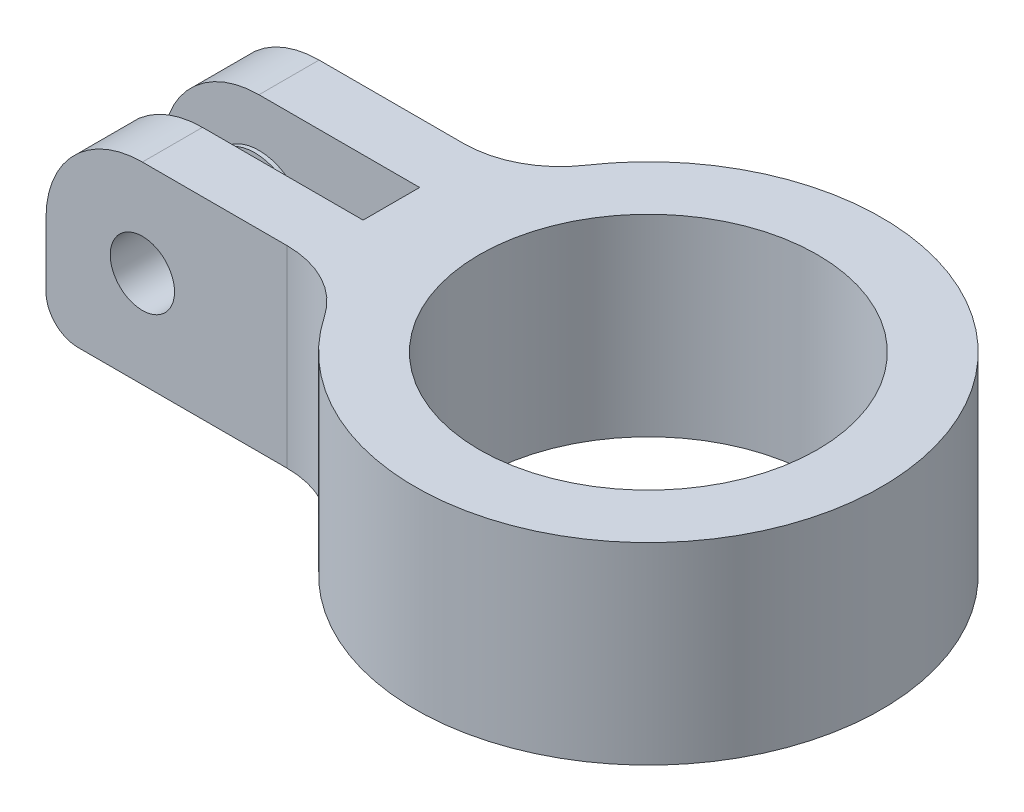
ISO-10303-21;
HEADER;
FILE_DESCRIPTION(('STEP AP214'),'2;1');
FILE_NAME('part.step','',(''),(''),'','','');
FILE_SCHEMA(('AUTOMOTIVE_DESIGN { 1 0 10303 214 1 1 1 1 }'));
ENDSEC;
DATA;
#1=APPLICATION_CONTEXT('core data for automotive mechanical design processes');
#2=APPLICATION_PROTOCOL_DEFINITION('international standard','automotive_design',2000,#1);
#3=PRODUCT_CONTEXT('',#1,'mechanical');
#4=PRODUCT('Part','Part','',(#3));
#5=PRODUCT_RELATED_PRODUCT_CATEGORY('part','',(#4));
#6=PRODUCT_DEFINITION_FORMATION('','',#4);
#7=PRODUCT_DEFINITION_CONTEXT('part definition',#1,'design');
#8=PRODUCT_DEFINITION('design','',#6,#7);
#9=PRODUCT_DEFINITION_SHAPE('','',#8);
#10=(LENGTH_UNIT() NAMED_UNIT(*) SI_UNIT(.MILLI.,.METRE.));
#11=(NAMED_UNIT(*) PLANE_ANGLE_UNIT() SI_UNIT($,.RADIAN.));
#12=(NAMED_UNIT(*) SI_UNIT($,.STERADIAN.) SOLID_ANGLE_UNIT());
#13=UNCERTAINTY_MEASURE_WITH_UNIT(LENGTH_MEASURE(1.E-05),#10,'distance_accuracy_value','');
#14=(GEOMETRIC_REPRESENTATION_CONTEXT(3) GLOBAL_UNCERTAINTY_ASSIGNED_CONTEXT((#13)) GLOBAL_UNIT_ASSIGNED_CONTEXT((#10,
#11,#12)) REPRESENTATION_CONTEXT('',''));
#15=CARTESIAN_POINT('',(0.,0.,0.));
#16=DIRECTION('',(0.,0.,1.));
#17=DIRECTION('',(1.,0.,0.));
#18=AXIS2_PLACEMENT_3D('',#15,#16,#17);
#19=CARTESIAN_POINT('',(0.,19.05,-2.794));
#20=DIRECTION('',(0.,0.,-1.));
#21=DIRECTION('',(-1.,0.,0.));
#22=AXIS2_PLACEMENT_3D('',#19,#20,#21);
#23=PLANE('',#22);
#24=DIRECTION('',(0.,-1.,0.));
#25=VECTOR('',#24,1.);
#26=CARTESIAN_POINT('',(-50.8,19.05,-2.794));
#27=LINE('',#26,#25);
#28=CARTESIAN_POINT('',(-50.8,9.525,-2.794));
#29=VERTEX_POINT('',#28);
#30=CARTESIAN_POINT('',(-50.8,3.17500000000001,-2.794));
#31=VERTEX_POINT('',#30);
#32=EDGE_CURVE('E170',#29,#31,#27,.T.);
#33=ORIENTED_EDGE('',*,*,#32,.T.);
#34=CARTESIAN_POINT('',(-47.625,3.175,-2.794));
#35=DIRECTION('',(0.,0.,-1.));
#36=DIRECTION('',(-1.,0.,0.));
#37=AXIS2_PLACEMENT_3D('',#34,#35,#36);
#38=CIRCLE('',#37,3.175);
#39=CARTESIAN_POINT('',(-47.625,0.,-2.794));
#40=VERTEX_POINT('',#39);
#41=EDGE_CURVE('E53',#31,#40,#38,.F.);
#42=ORIENTED_EDGE('',*,*,#41,.T.);
#43=DIRECTION('',(1.,0.,0.));
#44=VECTOR('',#43,1.);
#45=CARTESIAN_POINT('',(0.,0.,-2.794));
#46=LINE('',#45,#44);
#47=CARTESIAN_POINT('',(-25.4,0.,-2.794));
#48=VERTEX_POINT('',#47);
#49=EDGE_CURVE('E166',#40,#48,#46,.T.);
#50=ORIENTED_EDGE('',*,*,#49,.T.);
#51=DIRECTION('',(0.,-1.,0.));
#52=VECTOR('',#51,1.);
#53=CARTESIAN_POINT('',(-25.4,19.05,-2.794));
#54=LINE('',#53,#52);
#55=CARTESIAN_POINT('',(-25.4,19.05,-2.794));
#56=VERTEX_POINT('',#55);
#57=EDGE_CURVE('E162',#56,#48,#54,.T.);
#58=ORIENTED_EDGE('',*,*,#57,.F.);
#59=DIRECTION('',(1.,0.,0.));
#60=VECTOR('',#59,1.);
#61=CARTESIAN_POINT('',(0.,19.05,-2.794));
#62=LINE('',#61,#60);
#63=CARTESIAN_POINT('',(-41.275,19.05,-2.794));
#64=VERTEX_POINT('',#63);
#65=EDGE_CURVE('E146',#64,#56,#62,.T.);
#66=ORIENTED_EDGE('',*,*,#65,.F.);
#67=CARTESIAN_POINT('',(-41.275,9.525,-2.794));
#68=DIRECTION('',(0.,0.,-1.));
#69=DIRECTION('',(-1.,0.,0.));
#70=AXIS2_PLACEMENT_3D('',#67,#68,#69);
#71=CIRCLE('',#70,9.525);
#72=EDGE_CURVE('E265',#64,#29,#71,.F.);
#73=ORIENTED_EDGE('',*,*,#72,.T.);
#74=EDGE_LOOP('',(#33,#42,#50,#58,#66,#73));
#75=FACE_BOUND('',#74,.T.);
#76=CARTESIAN_POINT('',(-41.275,9.525,-2.794));
#77=DIRECTION('',(0.,0.,-1.));
#78=DIRECTION('',(-1.,0.,0.));
#79=AXIS2_PLACEMENT_3D('',#76,#77,#78);
#80=CIRCLE('',#79,4.7625);
#81=CARTESIAN_POINT('',(-46.0375,9.525,-2.794));
#82=VERTEX_POINT('',#81);
#83=EDGE_CURVE('E235',#82,#82,#80,.F.);
#84=ORIENTED_EDGE('',*,*,#83,.F.);
#85=EDGE_LOOP('',(#84));
#86=FACE_BOUND('',#85,.T.);
#87=ADVANCED_FACE('F44',(#75,#86),#23,.F.);
#88=CARTESIAN_POINT('',(0.,19.05,-8.73125));
#89=DIRECTION('',(0.,0.,1.));
#90=DIRECTION('',(1.,0.,0.));
#91=AXIS2_PLACEMENT_3D('',#88,#89,#90);
#92=PLANE('',#91);
#93=CARTESIAN_POINT('',(-41.275,9.525,-8.73125));
#94=DIRECTION('',(0.,0.,1.));
#95=DIRECTION('',(1.,0.,0.));
#96=AXIS2_PLACEMENT_3D('',#93,#94,#95);
#97=CIRCLE('',#96,3.17500000000001);
#98=CARTESIAN_POINT('',(-38.1,9.525,-8.73125));
#99=VERTEX_POINT('',#98);
#100=EDGE_CURVE('E199',#99,#99,#97,.T.);
#101=ORIENTED_EDGE('',*,*,#100,.T.);
#102=EDGE_LOOP('',(#101));
#103=FACE_BOUND('',#102,.T.);
#104=DIRECTION('',(-1.,0.,0.));
#105=VECTOR('',#104,1.);
#106=CARTESIAN_POINT('',(0.,0.,-8.73125));
#107=LINE('',#106,#105);
#108=CARTESIAN_POINT('',(-26.9791129614652,0.,-8.73125));
#109=VERTEX_POINT('',#108);
#110=CARTESIAN_POINT('',(-47.625,0.,-8.73125));
#111=VERTEX_POINT('',#110);
#112=EDGE_CURVE('E196',#109,#111,#107,.T.);
#113=ORIENTED_EDGE('',*,*,#112,.T.);
#114=CARTESIAN_POINT('',(-47.625,3.175,-8.73125));
#115=DIRECTION('',(0.,0.,1.));
#116=DIRECTION('',(1.,0.,0.));
#117=AXIS2_PLACEMENT_3D('',#114,#115,#116);
#118=CIRCLE('',#117,3.175);
#119=CARTESIAN_POINT('',(-50.8,3.17500000000001,-8.73125));
#120=VERTEX_POINT('',#119);
#121=EDGE_CURVE('E11',#111,#120,#118,.F.);
#122=ORIENTED_EDGE('',*,*,#121,.T.);
#123=DIRECTION('',(0.,-1.,0.));
#124=VECTOR('',#123,1.);
#125=CARTESIAN_POINT('',(-50.8,19.05,-8.73125));
#126=LINE('',#125,#124);
#127=CARTESIAN_POINT('',(-50.8,9.525,-8.73125));
#128=VERTEX_POINT('',#127);
#129=EDGE_CURVE('E232',#128,#120,#126,.T.);
#130=ORIENTED_EDGE('',*,*,#129,.F.);
#131=CARTESIAN_POINT('',(-41.275,9.525,-8.73125));
#132=DIRECTION('',(0.,0.,1.));
#133=DIRECTION('',(1.,0.,0.));
#134=AXIS2_PLACEMENT_3D('',#131,#132,#133);
#135=CIRCLE('',#134,9.525);
#136=CARTESIAN_POINT('',(-41.275,19.05,-8.73125));
#137=VERTEX_POINT('',#136);
#138=EDGE_CURVE('E252',#128,#137,#135,.F.);
#139=ORIENTED_EDGE('',*,*,#138,.T.);
#140=DIRECTION('',(-1.,0.,0.));
#141=VECTOR('',#140,1.);
#142=CARTESIAN_POINT('',(0.,19.05,-8.73125));
#143=LINE('',#142,#141);
#144=CARTESIAN_POINT('',(-26.9791129614652,19.05,-8.73125));
#145=VERTEX_POINT('',#144);
#146=EDGE_CURVE('E159',#145,#137,#143,.T.);
#147=ORIENTED_EDGE('',*,*,#146,.F.);
#148=DIRECTION('',(0.,1.,0.));
#149=VECTOR('',#148,1.);
#150=CARTESIAN_POINT('',(-26.9791129614652,0.,-8.73125));
#151=LINE('',#150,#149);
#152=EDGE_CURVE('E255',#145,#109,#151,.F.);
#153=ORIENTED_EDGE('',*,*,#152,.T.);
#154=EDGE_LOOP('',(#113,#122,#130,#139,#147,#153));
#155=FACE_BOUND('',#154,.T.);
#156=ADVANCED_FACE('F318',(#103,#155),#92,.F.);
#157=CARTESIAN_POINT('',(-50.8,19.05,0.));
#158=DIRECTION('',(1.,0.,0.));
#159=DIRECTION('',(0.,0.,-1.));
#160=AXIS2_PLACEMENT_3D('',#157,#158,#159);
#161=PLANE('',#160);
#162=ORIENTED_EDGE('',*,*,#129,.T.);
#163=DIRECTION('',(0.,0.,1.));
#164=VECTOR('',#163,1.);
#165=CARTESIAN_POINT('',(-50.8,3.175,0.));
#166=LINE('',#165,#164);
#167=EDGE_CURVE('E305',#120,#31,#166,.T.);
#168=ORIENTED_EDGE('',*,*,#167,.T.);
#169=ORIENTED_EDGE('',*,*,#32,.F.);
#170=DIRECTION('',(0.,0.,1.));
#171=VECTOR('',#170,1.);
#172=CARTESIAN_POINT('',(-50.8,9.525,-8.73125));
#173=LINE('',#172,#171);
#174=EDGE_CURVE('E268',#29,#128,#173,.F.);
#175=ORIENTED_EDGE('',*,*,#174,.T.);
#176=EDGE_LOOP('',(#162,#168,#169,#175));
#177=FACE_BOUND('',#176,.T.);
#178=ADVANCED_FACE('F315',(#177),#161,.F.);
#179=CARTESIAN_POINT('',(-25.4,19.05,0.));
#180=DIRECTION('',(1.,0.,0.));
#181=DIRECTION('',(0.,0.,-1.));
#182=AXIS2_PLACEMENT_3D('',#179,#180,#181);
#183=PLANE('',#182);
#184=DIRECTION('',(0.,0.,1.));
#185=VECTOR('',#184,1.);
#186=CARTESIAN_POINT('',(-25.4,0.,0.));
#187=LINE('',#186,#185);
#188=CARTESIAN_POINT('',(-25.4,0.,2.794));
#189=VERTEX_POINT('',#188);
#190=EDGE_CURVE('E202',#48,#189,#187,.T.);
#191=ORIENTED_EDGE('',*,*,#190,.T.);
#192=DIRECTION('',(0.,-1.,0.));
#193=VECTOR('',#192,1.);
#194=CARTESIAN_POINT('',(-25.4,19.05,2.794));
#195=LINE('',#194,#193);
#196=CARTESIAN_POINT('',(-25.4,19.05,2.794));
#197=VERTEX_POINT('',#196);
#198=EDGE_CURVE('E171',#197,#189,#195,.T.);
#199=ORIENTED_EDGE('',*,*,#198,.F.);
#200=DIRECTION('',(0.,0.,1.));
#201=VECTOR('',#200,1.);
#202=CARTESIAN_POINT('',(-25.4,19.05,0.));
#203=LINE('',#202,#201);
#204=EDGE_CURVE('E153',#56,#197,#203,.T.);
#205=ORIENTED_EDGE('',*,*,#204,.F.);
#206=ORIENTED_EDGE('',*,*,#57,.T.);
#207=EDGE_LOOP('',(#191,#199,#205,#206));
#208=FACE_BOUND('',#207,.T.);
#209=ADVANCED_FACE('F173',(#208),#183,.F.);
#210=CARTESIAN_POINT('',(0.,19.05,2.794));
#211=DIRECTION('',(0.,0.,1.));
#212=DIRECTION('',(1.,0.,0.));
#213=AXIS2_PLACEMENT_3D('',#210,#211,#212);
#214=PLANE('',#213);
#215=CARTESIAN_POINT('',(-41.275,9.525,2.794));
#216=DIRECTION('',(0.,0.,1.));
#217=DIRECTION('',(1.,0.,0.));
#218=AXIS2_PLACEMENT_3D('',#215,#216,#217);
#219=CIRCLE('',#218,4.7625);
#220=CARTESIAN_POINT('',(-36.5125,9.525,2.794));
#221=VERTEX_POINT('',#220);
#222=EDGE_CURVE('E378',#221,#221,#219,.T.);
#223=ORIENTED_EDGE('',*,*,#222,.T.);
#224=EDGE_LOOP('',(#223));
#225=FACE_BOUND('',#224,.T.);
#226=DIRECTION('',(-1.,0.,0.));
#227=VECTOR('',#226,1.);
#228=CARTESIAN_POINT('',(0.,0.,2.794));
#229=LINE('',#228,#227);
#230=CARTESIAN_POINT('',(-47.625,0.,2.794));
#231=VERTEX_POINT('',#230);
#232=EDGE_CURVE('E205',#189,#231,#229,.T.);
#233=ORIENTED_EDGE('',*,*,#232,.T.);
#234=CARTESIAN_POINT('',(-47.625,3.175,2.794));
#235=DIRECTION('',(0.,0.,1.));
#236=DIRECTION('',(1.,0.,0.));
#237=AXIS2_PLACEMENT_3D('',#234,#235,#236);
#238=CIRCLE('',#237,3.175);
#239=CARTESIAN_POINT('',(-50.8,3.17500000000001,2.794));
#240=VERTEX_POINT('',#239);
#241=EDGE_CURVE('E302',#231,#240,#238,.F.);
#242=ORIENTED_EDGE('',*,*,#241,.T.);
#243=DIRECTION('',(0.,-1.,0.));
#244=VECTOR('',#243,1.);
#245=CARTESIAN_POINT('',(-50.8,19.05,2.794));
#246=LINE('',#245,#244);
#247=CARTESIAN_POINT('',(-50.8,9.525,2.794));
#248=VERTEX_POINT('',#247);
#249=EDGE_CURVE('E224',#248,#240,#246,.T.);
#250=ORIENTED_EDGE('',*,*,#249,.F.);
#251=CARTESIAN_POINT('',(-41.275,9.525,2.794));
#252=DIRECTION('',(0.,0.,1.));
#253=DIRECTION('',(1.,0.,0.));
#254=AXIS2_PLACEMENT_3D('',#251,#252,#253);
#255=CIRCLE('',#254,9.525);
#256=CARTESIAN_POINT('',(-41.275,19.05,2.794));
#257=VERTEX_POINT('',#256);
#258=EDGE_CURVE('E274',#248,#257,#255,.F.);
#259=ORIENTED_EDGE('',*,*,#258,.T.);
#260=DIRECTION('',(-1.,0.,0.));
#261=VECTOR('',#260,1.);
#262=CARTESIAN_POINT('',(0.,19.05,2.794));
#263=LINE('',#262,#261);
#264=EDGE_CURVE('E177',#197,#257,#263,.T.);
#265=ORIENTED_EDGE('',*,*,#264,.F.);
#266=ORIENTED_EDGE('',*,*,#198,.T.);
#267=EDGE_LOOP('',(#233,#242,#250,#259,#265,#266));
#268=FACE_BOUND('',#267,.T.);
#269=ADVANCED_FACE('F433',(#225,#268),#214,.F.);
#270=CARTESIAN_POINT('',(-50.8,19.05,0.));
#271=DIRECTION('',(1.,0.,0.));
#272=DIRECTION('',(0.,0.,-1.));
#273=AXIS2_PLACEMENT_3D('',#270,#271,#272);
#274=PLANE('',#273);
#275=ORIENTED_EDGE('',*,*,#249,.T.);
#276=DIRECTION('',(0.,0.,1.));
#277=VECTOR('',#276,1.);
#278=CARTESIAN_POINT('',(-50.8,3.175,0.));
#279=LINE('',#278,#277);
#280=CARTESIAN_POINT('',(-50.8,3.17500000000001,8.73125));
#281=VERTEX_POINT('',#280);
#282=EDGE_CURVE('E289',#240,#281,#279,.T.);
#283=ORIENTED_EDGE('',*,*,#282,.T.);
#284=DIRECTION('',(0.,-1.,0.));
#285=VECTOR('',#284,1.);
#286=CARTESIAN_POINT('',(-50.8,19.05,8.73125));
#287=LINE('',#286,#285);
#288=CARTESIAN_POINT('',(-50.8,9.525,8.73125));
#289=VERTEX_POINT('',#288);
#290=EDGE_CURVE('E195',#289,#281,#287,.T.);
#291=ORIENTED_EDGE('',*,*,#290,.F.);
#292=DIRECTION('',(0.,0.,1.));
#293=VECTOR('',#292,1.);
#294=CARTESIAN_POINT('',(-50.8,9.525,2.794));
#295=LINE('',#294,#293);
#296=EDGE_CURVE('E271',#289,#248,#295,.F.);
#297=ORIENTED_EDGE('',*,*,#296,.T.);
#298=EDGE_LOOP('',(#275,#283,#291,#297));
#299=FACE_BOUND('',#298,.T.);
#300=ADVANCED_FACE('F430',(#299),#274,.F.);
#301=CARTESIAN_POINT('',(0.,19.05,8.73125));
#302=DIRECTION('',(0.,0.,1.));
#303=DIRECTION('',(1.,0.,0.));
#304=AXIS2_PLACEMENT_3D('',#301,#302,#303);
#305=PLANE('',#304);
#306=ORIENTED_EDGE('',*,*,#290,.T.);
#307=CARTESIAN_POINT('',(-47.625,3.175,8.73125));
#308=DIRECTION('',(0.,0.,1.));
#309=DIRECTION('',(1.,0.,0.));
#310=AXIS2_PLACEMENT_3D('',#307,#308,#309);
#311=CIRCLE('',#310,3.175);
#312=CARTESIAN_POINT('',(-47.625,0.,8.73125));
#313=VERTEX_POINT('',#312);
#314=EDGE_CURVE('E293',#281,#313,#311,.T.);
#315=ORIENTED_EDGE('',*,*,#314,.T.);
#316=DIRECTION('',(-1.,0.,0.));
#317=VECTOR('',#316,1.);
#318=CARTESIAN_POINT('',(0.,0.,8.73125));
#319=LINE('',#318,#317);
#320=CARTESIAN_POINT('',(-26.9791129614652,0.,8.73125));
#321=VERTEX_POINT('',#320);
#322=EDGE_CURVE('E209',#321,#313,#319,.T.);
#323=ORIENTED_EDGE('',*,*,#322,.F.);
#324=DIRECTION('',(0.,-1.,0.));
#325=VECTOR('',#324,1.);
#326=CARTESIAN_POINT('',(-26.9791129614652,19.05,8.73125));
#327=LINE('',#326,#325);
#328=CARTESIAN_POINT('',(-26.9791129614652,19.05,8.73125));
#329=VERTEX_POINT('',#328);
#330=EDGE_CURVE('E249',#321,#329,#327,.F.);
#331=ORIENTED_EDGE('',*,*,#330,.T.);
#332=DIRECTION('',(-1.,0.,0.));
#333=VECTOR('',#332,1.);
#334=CARTESIAN_POINT('',(0.,19.05,8.73125));
#335=LINE('',#334,#333);
#336=CARTESIAN_POINT('',(-41.275,19.05,8.73125));
#337=VERTEX_POINT('',#336);
#338=EDGE_CURVE('E180',#329,#337,#335,.T.);
#339=ORIENTED_EDGE('',*,*,#338,.T.);
#340=CARTESIAN_POINT('',(-41.275,9.525,8.73125));
#341=DIRECTION('',(0.,0.,1.));
#342=DIRECTION('',(1.,0.,0.));
#343=AXIS2_PLACEMENT_3D('',#340,#341,#342);
#344=CIRCLE('',#343,9.525);
#345=EDGE_CURVE('E246',#337,#289,#344,.T.);
#346=ORIENTED_EDGE('',*,*,#345,.T.);
#347=EDGE_LOOP('',(#306,#315,#323,#331,#339,#346));
#348=FACE_BOUND('',#347,.T.);
#349=CARTESIAN_POINT('',(-41.275,9.525,8.73125));
#350=DIRECTION('',(0.,0.,1.));
#351=DIRECTION('',(1.,0.,0.));
#352=AXIS2_PLACEMENT_3D('',#349,#350,#351);
#353=CIRCLE('',#352,3.17500000000001);
#354=CARTESIAN_POINT('',(-38.1,9.525,8.73125));
#355=VERTEX_POINT('',#354);
#356=EDGE_CURVE('E374',#355,#355,#353,.T.);
#357=ORIENTED_EDGE('',*,*,#356,.F.);
#358=EDGE_LOOP('',(#357));
#359=FACE_BOUND('',#358,.T.);
#360=ADVANCED_FACE('F427',(#348,#359),#305,.T.);
#361=CARTESIAN_POINT('',(0.,19.05,0.));
#362=DIRECTION('',(0.,-1.,0.));
#363=DIRECTION('',(0.,0.,-1.));
#364=AXIS2_PLACEMENT_3D('',#361,#362,#363);
#365=CYLINDRICAL_SURFACE('',#364,23.0505);
#366=CARTESIAN_POINT('',(0.,19.05,0.));
#367=DIRECTION('',(0.,1.,0.));
#368=DIRECTION('',(0.,0.,1.));
#369=AXIS2_PLACEMENT_3D('',#366,#367,#368);
#370=CIRCLE('',#369,23.0505);
#371=CARTESIAN_POINT('',(-19.090483440569,19.05,12.9181652046784));
#372=VERTEX_POINT('',#371);
#373=CARTESIAN_POINT('',(-19.090483440569,19.05,-12.9181652046784));
#374=VERTEX_POINT('',#373);
#375=EDGE_CURVE('E187',#372,#374,#370,.T.);
#376=ORIENTED_EDGE('',*,*,#375,.F.);
#377=DIRECTION('',(0.,-1.,0.));
#378=VECTOR('',#377,1.);
#379=CARTESIAN_POINT('',(-19.090483440569,19.05,12.9181652046784));
#380=LINE('',#379,#378);
#381=CARTESIAN_POINT('',(-19.090483440569,0.,12.9181652046784));
#382=VERTEX_POINT('',#381);
#383=EDGE_CURVE('E242',#372,#382,#380,.T.);
#384=ORIENTED_EDGE('',*,*,#383,.T.);
#385=CARTESIAN_POINT('',(0.,0.,0.));
#386=DIRECTION('',(0.,1.,0.));
#387=DIRECTION('',(0.,0.,1.));
#388=AXIS2_PLACEMENT_3D('',#385,#386,#387);
#389=CIRCLE('',#388,23.0505);
#390=CARTESIAN_POINT('',(-19.090483440569,0.,-12.9181652046784));
#391=VERTEX_POINT('',#390);
#392=EDGE_CURVE('E213',#382,#391,#389,.T.);
#393=ORIENTED_EDGE('',*,*,#392,.T.);
#394=DIRECTION('',(0.,-1.,0.));
#395=VECTOR('',#394,1.);
#396=CARTESIAN_POINT('',(-19.090483440569,19.05,-12.9181652046784));
#397=LINE('',#396,#395);
#398=EDGE_CURVE('E239',#391,#374,#397,.F.);
#399=ORIENTED_EDGE('',*,*,#398,.T.);
#400=EDGE_LOOP('',(#376,#384,#393,#399));
#401=FACE_BOUND('',#400,.T.);
#402=ADVANCED_FACE('F365',(#401),#365,.T.);
#403=CARTESIAN_POINT('',(0.,19.05,0.));
#404=DIRECTION('',(0.,-1.,0.));
#405=DIRECTION('',(0.,0.,-1.));
#406=AXIS2_PLACEMENT_3D('',#403,#404,#405);
#407=CYLINDRICAL_SURFACE('',#406,16.7005);
#408=CARTESIAN_POINT('',(0.,19.05,0.));
#409=DIRECTION('',(0.,1.,0.));
#410=DIRECTION('',(0.,0.,1.));
#411=AXIS2_PLACEMENT_3D('',#408,#409,#410);
#412=CIRCLE('',#411,16.7005);
#413=CARTESIAN_POINT('',(0.,19.05,16.7005));
#414=VERTEX_POINT('',#413);
#415=EDGE_CURVE('E191',#414,#414,#412,.T.);
#416=ORIENTED_EDGE('',*,*,#415,.T.);
#417=EDGE_LOOP('',(#416));
#418=FACE_BOUND('',#417,.T.);
#419=CARTESIAN_POINT('',(0.,0.,0.));
#420=DIRECTION('',(0.,1.,0.));
#421=DIRECTION('',(0.,0.,1.));
#422=AXIS2_PLACEMENT_3D('',#419,#420,#421);
#423=CIRCLE('',#422,16.7005);
#424=CARTESIAN_POINT('',(0.,0.,16.7005));
#425=VERTEX_POINT('',#424);
#426=EDGE_CURVE('E217',#425,#425,#423,.T.);
#427=ORIENTED_EDGE('',*,*,#426,.F.);
#428=EDGE_LOOP('',(#427));
#429=FACE_BOUND('',#428,.T.);
#430=ADVANCED_FACE('F419',(#418,#429),#407,.F.);
#431=CARTESIAN_POINT('',(0.,19.05,0.));
#432=DIRECTION('',(0.,1.,0.));
#433=DIRECTION('',(0.,0.,1.));
#434=AXIS2_PLACEMENT_3D('',#431,#432,#433);
#435=PLANE('',#434);
#436=ORIENTED_EDGE('',*,*,#146,.T.);
#437=DIRECTION('',(0.,0.,1.));
#438=VECTOR('',#437,1.);
#439=CARTESIAN_POINT('',(-41.275,19.05,-2.794));
#440=LINE('',#439,#438);
#441=EDGE_CURVE('E156',#137,#64,#440,.T.);
#442=ORIENTED_EDGE('',*,*,#441,.T.);
#443=ORIENTED_EDGE('',*,*,#65,.T.);
#444=ORIENTED_EDGE('',*,*,#204,.T.);
#445=ORIENTED_EDGE('',*,*,#264,.T.);
#446=DIRECTION('',(0.,0.,1.));
#447=VECTOR('',#446,1.);
#448=CARTESIAN_POINT('',(-41.275,19.05,8.73125));
#449=LINE('',#448,#447);
#450=EDGE_CURVE('E259',#257,#337,#449,.T.);
#451=ORIENTED_EDGE('',*,*,#450,.T.);
#452=ORIENTED_EDGE('',*,*,#338,.F.);
#453=CARTESIAN_POINT('',(-26.9791129614652,19.05,18.25625));
#454=DIRECTION('',(0.,1.,0.));
#455=DIRECTION('',(0.,0.,1.));
#456=AXIS2_PLACEMENT_3D('',#453,#454,#455);
#457=CIRCLE('',#456,9.525);
#458=EDGE_CURVE('E280',#329,#372,#457,.F.);
#459=ORIENTED_EDGE('',*,*,#458,.T.);
#460=ORIENTED_EDGE('',*,*,#375,.T.);
#461=CARTESIAN_POINT('',(-26.9791129614652,19.05,-18.25625));
#462=DIRECTION('',(0.,1.,0.));
#463=DIRECTION('',(0.,0.,1.));
#464=AXIS2_PLACEMENT_3D('',#461,#462,#463);
#465=CIRCLE('',#464,9.525);
#466=EDGE_CURVE('E286',#374,#145,#465,.F.);
#467=ORIENTED_EDGE('',*,*,#466,.T.);
#468=EDGE_LOOP('',(#436,#442,#443,#444,#445,#451,#452,#459,#460,#467));
#469=FACE_BOUND('',#468,.T.);
#470=ORIENTED_EDGE('',*,*,#415,.F.);
#471=EDGE_LOOP('',(#470));
#472=FACE_BOUND('',#471,.T.);
#473=ADVANCED_FACE('F149',(#469,#472),#435,.T.);
#474=CARTESIAN_POINT('',(0.,0.,0.));
#475=DIRECTION('',(0.,1.,0.));
#476=DIRECTION('',(0.,0.,1.));
#477=AXIS2_PLACEMENT_3D('',#474,#475,#476);
#478=PLANE('',#477);
#479=ORIENTED_EDGE('',*,*,#322,.T.);
#480=DIRECTION('',(0.,0.,1.));
#481=VECTOR('',#480,1.);
#482=CARTESIAN_POINT('',(-47.625,0.,0.));
#483=LINE('',#482,#481);
#484=EDGE_CURVE('E299',#313,#231,#483,.F.);
#485=ORIENTED_EDGE('',*,*,#484,.T.);
#486=ORIENTED_EDGE('',*,*,#232,.F.);
#487=ORIENTED_EDGE('',*,*,#190,.F.);
#488=ORIENTED_EDGE('',*,*,#49,.F.);
#489=DIRECTION('',(0.,0.,1.));
#490=VECTOR('',#489,1.);
#491=CARTESIAN_POINT('',(-47.625,0.,0.));
#492=LINE('',#491,#490);
#493=EDGE_CURVE('E296',#40,#111,#492,.F.);
#494=ORIENTED_EDGE('',*,*,#493,.T.);
#495=ORIENTED_EDGE('',*,*,#112,.F.);
#496=CARTESIAN_POINT('',(-26.9791129614652,0.,-18.25625));
#497=DIRECTION('',(0.,1.,0.));
#498=DIRECTION('',(0.,0.,1.));
#499=AXIS2_PLACEMENT_3D('',#496,#497,#498);
#500=CIRCLE('',#499,9.525);
#501=EDGE_CURVE('E283',#109,#391,#500,.T.);
#502=ORIENTED_EDGE('',*,*,#501,.T.);
#503=ORIENTED_EDGE('',*,*,#392,.F.);
#504=CARTESIAN_POINT('',(-26.9791129614652,0.,18.25625));
#505=DIRECTION('',(0.,1.,0.));
#506=DIRECTION('',(0.,0.,1.));
#507=AXIS2_PLACEMENT_3D('',#504,#505,#506);
#508=CIRCLE('',#507,9.525);
#509=EDGE_CURVE('E277',#382,#321,#508,.T.);
#510=ORIENTED_EDGE('',*,*,#509,.T.);
#511=EDGE_LOOP('',(#479,#485,#486,#487,#488,#494,#495,#502,#503,#510));
#512=FACE_BOUND('',#511,.T.);
#513=ORIENTED_EDGE('',*,*,#426,.T.);
#514=EDGE_LOOP('',(#513));
#515=FACE_BOUND('',#514,.T.);
#516=ADVANCED_FACE('F310',(#512,#515),#478,.F.);
#517=CARTESIAN_POINT('',(-41.275,9.525,-23.0505));
#518=DIRECTION('',(0.,0.,1.));
#519=DIRECTION('',(1.,0.,0.));
#520=AXIS2_PLACEMENT_3D('',#517,#518,#519);
#521=CYLINDRICAL_SURFACE('',#520,3.17500000000001);
#522=ORIENTED_EDGE('',*,*,#356,.T.);
#523=EDGE_LOOP('',(#522));
#524=FACE_BOUND('',#523,.T.);
#525=CARTESIAN_POINT('',(-41.275,9.525,2.38125));
#526=DIRECTION('',(0.,0.,1.));
#527=DIRECTION('',(1.,0.,0.));
#528=AXIS2_PLACEMENT_3D('',#525,#526,#527);
#529=CIRCLE('',#528,3.17500000000001);
#530=CARTESIAN_POINT('',(-38.1,9.525,2.38125));
#531=VERTEX_POINT('',#530);
#532=EDGE_CURVE('E386',#531,#531,#529,.T.);
#533=ORIENTED_EDGE('',*,*,#532,.F.);
#534=EDGE_LOOP('',(#533));
#535=FACE_BOUND('',#534,.T.);
#536=ADVANCED_FACE('F403',(#524,#535),#521,.F.);
#537=ORIENTED_EDGE('',*,*,#100,.F.);
#538=EDGE_LOOP('',(#537));
#539=FACE_BOUND('',#538,.T.);
#540=CARTESIAN_POINT('',(-41.275,9.525,-2.38125));
#541=DIRECTION('',(0.,0.,1.));
#542=DIRECTION('',(1.,0.,0.));
#543=AXIS2_PLACEMENT_3D('',#540,#541,#542);
#544=CIRCLE('',#543,3.17500000000001);
#545=CARTESIAN_POINT('',(-38.1,9.525,-2.38125));
#546=VERTEX_POINT('',#545);
#547=EDGE_CURVE('E394',#546,#546,#544,.T.);
#548=ORIENTED_EDGE('',*,*,#547,.T.);
#549=EDGE_LOOP('',(#548));
#550=FACE_BOUND('',#549,.T.);
#551=ADVANCED_FACE('F399',(#539,#550),#521,.F.);
#552=CARTESIAN_POINT('',(-41.275,9.525,2.38125));
#553=DIRECTION('',(0.,0.,1.));
#554=DIRECTION('',(1.,0.,0.));
#555=AXIS2_PLACEMENT_3D('',#552,#553,#554);
#556=CYLINDRICAL_SURFACE('',#555,4.7625);
#557=CARTESIAN_POINT('',(-41.275,9.525,2.38125));
#558=DIRECTION('',(0.,0.,1.));
#559=DIRECTION('',(1.,0.,0.));
#560=AXIS2_PLACEMENT_3D('',#557,#558,#559);
#561=CIRCLE('',#560,4.7625);
#562=CARTESIAN_POINT('',(-36.5125,9.525,2.38125));
#563=VERTEX_POINT('',#562);
#564=EDGE_CURVE('E382',#563,#563,#561,.T.);
#565=ORIENTED_EDGE('',*,*,#564,.T.);
#566=EDGE_LOOP('',(#565));
#567=FACE_BOUND('',#566,.T.);
#568=ORIENTED_EDGE('',*,*,#222,.F.);
#569=EDGE_LOOP('',(#568));
#570=FACE_BOUND('',#569,.T.);
#571=ADVANCED_FACE('F402',(#567,#570),#556,.T.);
#572=CARTESIAN_POINT('',(-41.275,9.525,2.38125));
#573=DIRECTION('',(0.,0.,1.));
#574=DIRECTION('',(1.,0.,0.));
#575=AXIS2_PLACEMENT_3D('',#572,#573,#574);
#576=PLANE('',#575);
#577=ORIENTED_EDGE('',*,*,#532,.T.);
#578=EDGE_LOOP('',(#577));
#579=FACE_BOUND('',#578,.T.);
#580=ORIENTED_EDGE('',*,*,#564,.F.);
#581=EDGE_LOOP('',(#580));
#582=FACE_BOUND('',#581,.T.);
#583=ADVANCED_FACE('F410',(#579,#582),#576,.F.);
#584=CARTESIAN_POINT('',(-41.275,9.525,-2.38125));
#585=DIRECTION('',(0.,0.,-1.));
#586=DIRECTION('',(-1.,0.,0.));
#587=AXIS2_PLACEMENT_3D('',#584,#585,#586);
#588=CYLINDRICAL_SURFACE('',#587,4.7625);
#589=CARTESIAN_POINT('',(-41.275,9.525,-2.38125));
#590=DIRECTION('',(0.,0.,1.));
#591=DIRECTION('',(1.,0.,0.));
#592=AXIS2_PLACEMENT_3D('',#589,#590,#591);
#593=CIRCLE('',#592,4.7625);
#594=CARTESIAN_POINT('',(-36.5125,9.525,-2.38125));
#595=VERTEX_POINT('',#594);
#596=EDGE_CURVE('E390',#595,#595,#593,.T.);
#597=ORIENTED_EDGE('',*,*,#596,.F.);
#598=EDGE_LOOP('',(#597));
#599=FACE_BOUND('',#598,.T.);
#600=ORIENTED_EDGE('',*,*,#83,.T.);
#601=EDGE_LOOP('',(#600));
#602=FACE_BOUND('',#601,.T.);
#603=ADVANCED_FACE('F355',(#599,#602),#588,.T.);
#604=CARTESIAN_POINT('',(-41.275,9.525,-2.38125));
#605=DIRECTION('',(0.,0.,-1.));
#606=DIRECTION('',(1.,0.,0.));
#607=AXIS2_PLACEMENT_3D('',#604,#605,#606);
#608=PLANE('',#607);
#609=ORIENTED_EDGE('',*,*,#596,.T.);
#610=EDGE_LOOP('',(#609));
#611=FACE_BOUND('',#610,.T.);
#612=ORIENTED_EDGE('',*,*,#547,.F.);
#613=EDGE_LOOP('',(#612));
#614=FACE_BOUND('',#613,.T.);
#615=ADVANCED_FACE('F350',(#611,#614),#608,.F.);
#616=CARTESIAN_POINT('',(-26.9791129614652,19.05,18.25625));
#617=DIRECTION('',(0.,-1.,0.));
#618=DIRECTION('',(0.,0.,-1.));
#619=AXIS2_PLACEMENT_3D('',#616,#617,#618);
#620=CYLINDRICAL_SURFACE('',#619,9.525);
#621=ORIENTED_EDGE('',*,*,#458,.F.);
#622=ORIENTED_EDGE('',*,*,#330,.F.);
#623=ORIENTED_EDGE('',*,*,#509,.F.);
#624=ORIENTED_EDGE('',*,*,#383,.F.);
#625=EDGE_LOOP('',(#621,#622,#623,#624));
#626=FACE_BOUND('',#625,.T.);
#627=ADVANCED_FACE('F333',(#626),#620,.F.);
#628=CARTESIAN_POINT('',(-26.9791129614652,19.05,-18.25625));
#629=DIRECTION('',(0.,-1.,0.));
#630=DIRECTION('',(0.,0.,-1.));
#631=AXIS2_PLACEMENT_3D('',#628,#629,#630);
#632=CYLINDRICAL_SURFACE('',#631,9.525);
#633=ORIENTED_EDGE('',*,*,#466,.F.);
#634=ORIENTED_EDGE('',*,*,#398,.F.);
#635=ORIENTED_EDGE('',*,*,#501,.F.);
#636=ORIENTED_EDGE('',*,*,#152,.F.);
#637=EDGE_LOOP('',(#633,#634,#635,#636));
#638=FACE_BOUND('',#637,.T.);
#639=ADVANCED_FACE('F324',(#638),#632,.F.);
#640=CARTESIAN_POINT('',(-41.275,9.525,0.));
#641=DIRECTION('',(0.,0.,-1.));
#642=DIRECTION('',(-1.,0.,0.));
#643=AXIS2_PLACEMENT_3D('',#640,#641,#642);
#644=CYLINDRICAL_SURFACE('',#643,9.525);
#645=ORIENTED_EDGE('',*,*,#138,.F.);
#646=ORIENTED_EDGE('',*,*,#174,.F.);
#647=ORIENTED_EDGE('',*,*,#72,.F.);
#648=ORIENTED_EDGE('',*,*,#441,.F.);
#649=EDGE_LOOP('',(#645,#646,#647,#648));
#650=FACE_BOUND('',#649,.T.);
#651=ADVANCED_FACE('F321',(#650),#644,.T.);
#652=CARTESIAN_POINT('',(-41.275,9.525,0.));
#653=DIRECTION('',(0.,0.,-1.));
#654=DIRECTION('',(-1.,0.,0.));
#655=AXIS2_PLACEMENT_3D('',#652,#653,#654);
#656=CYLINDRICAL_SURFACE('',#655,9.525);
#657=ORIENTED_EDGE('',*,*,#258,.F.);
#658=ORIENTED_EDGE('',*,*,#296,.F.);
#659=ORIENTED_EDGE('',*,*,#345,.F.);
#660=ORIENTED_EDGE('',*,*,#450,.F.);
#661=EDGE_LOOP('',(#657,#658,#659,#660));
#662=FACE_BOUND('',#661,.T.);
#663=ADVANCED_FACE('F323',(#662),#656,.T.);
#664=CARTESIAN_POINT('',(-47.625,3.175,0.));
#665=DIRECTION('',(0.,0.,1.));
#666=DIRECTION('',(1.,0.,0.));
#667=AXIS2_PLACEMENT_3D('',#664,#665,#666);
#668=CYLINDRICAL_SURFACE('',#667,3.175);
#669=ORIENTED_EDGE('',*,*,#241,.F.);
#670=ORIENTED_EDGE('',*,*,#484,.F.);
#671=ORIENTED_EDGE('',*,*,#314,.F.);
#672=ORIENTED_EDGE('',*,*,#282,.F.);
#673=EDGE_LOOP('',(#669,#670,#671,#672));
#674=FACE_BOUND('',#673,.T.);
#675=ADVANCED_FACE('F330',(#674),#668,.T.);
#676=CARTESIAN_POINT('',(-47.625,3.175,0.));
#677=DIRECTION('',(0.,0.,1.));
#678=DIRECTION('',(1.,0.,0.));
#679=AXIS2_PLACEMENT_3D('',#676,#677,#678);
#680=CYLINDRICAL_SURFACE('',#679,3.175);
#681=ORIENTED_EDGE('',*,*,#121,.F.);
#682=ORIENTED_EDGE('',*,*,#493,.F.);
#683=ORIENTED_EDGE('',*,*,#41,.F.);
#684=ORIENTED_EDGE('',*,*,#167,.F.);
#685=EDGE_LOOP('',(#681,#682,#683,#684));
#686=FACE_BOUND('',#685,.T.);
#687=ADVANCED_FACE('F46',(#686),#680,.T.);
#688=CLOSED_SHELL('',(#87,#156,#178,#209,#269,#300,#360,#402,#430,#473,#516,#536,#551,#571,#583,
#603,#615,#627,#639,#651,#663,#675,#687));
#689=MANIFOLD_SOLID_BREP('B2',#688);
#690=ADVANCED_BREP_SHAPE_REPRESENTATION('',(#18,#689),#14);
#691=SHAPE_DEFINITION_REPRESENTATION(#9,#690);
ENDSEC;
END-ISO-10303-21;
